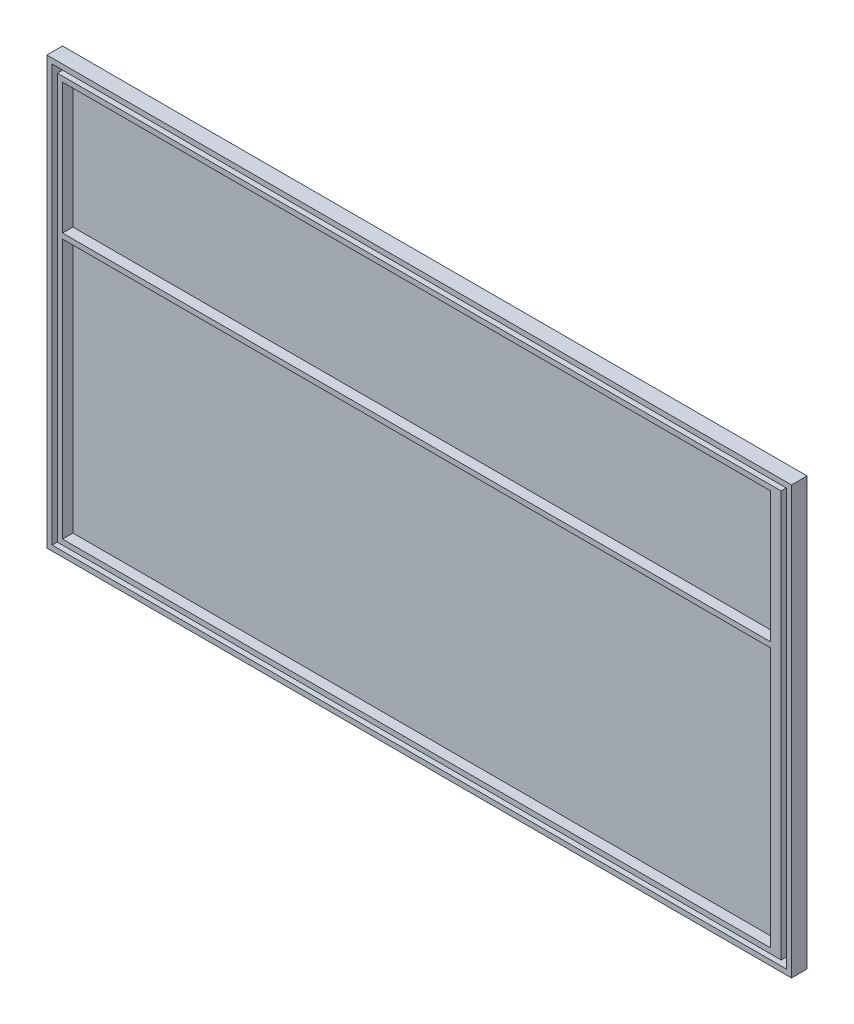
ISO-10303-21;
HEADER;
FILE_DESCRIPTION(('STEP AP214'),'2;1');
FILE_NAME('part.step','',(''),(''),'','','');
FILE_SCHEMA(('AUTOMOTIVE_DESIGN { 1 0 10303 214 1 1 1 1 }'));
ENDSEC;
DATA;
#1=APPLICATION_CONTEXT('core data for automotive mechanical design processes');
#2=APPLICATION_PROTOCOL_DEFINITION('international standard','automotive_design',2000,#1);
#3=PRODUCT_CONTEXT('',#1,'mechanical');
#4=PRODUCT('Part','Part','',(#3));
#5=PRODUCT_RELATED_PRODUCT_CATEGORY('part','',(#4));
#6=PRODUCT_DEFINITION_FORMATION('','',#4);
#7=PRODUCT_DEFINITION_CONTEXT('part definition',#1,'design');
#8=PRODUCT_DEFINITION('design','',#6,#7);
#9=PRODUCT_DEFINITION_SHAPE('','',#8);
#10=(LENGTH_UNIT() NAMED_UNIT(*) SI_UNIT(.MILLI.,.METRE.));
#11=(NAMED_UNIT(*) PLANE_ANGLE_UNIT() SI_UNIT($,.RADIAN.));
#12=(NAMED_UNIT(*) SI_UNIT($,.STERADIAN.) SOLID_ANGLE_UNIT());
#13=UNCERTAINTY_MEASURE_WITH_UNIT(LENGTH_MEASURE(1.E-05),#10,'distance_accuracy_value','');
#14=(GEOMETRIC_REPRESENTATION_CONTEXT(3) GLOBAL_UNCERTAINTY_ASSIGNED_CONTEXT((#13)) GLOBAL_UNIT_ASSIGNED_CONTEXT((#10,
#11,#12)) REPRESENTATION_CONTEXT('',''));
#15=CARTESIAN_POINT('',(0.,0.,0.));
#16=DIRECTION('',(0.,0.,1.));
#17=DIRECTION('',(1.,0.,0.));
#18=AXIS2_PLACEMENT_3D('',#15,#16,#17);
#19=CARTESIAN_POINT('',(0.,0.,1.));
#20=DIRECTION('',(0.,0.,1.));
#21=DIRECTION('',(1.,0.,0.));
#22=AXIS2_PLACEMENT_3D('',#19,#20,#21);
#23=PLANE('',#22);
#24=DIRECTION('',(0.,-1.,0.));
#25=VECTOR('',#24,1.);
#26=CARTESIAN_POINT('',(-30.0228259219912,0.,1.));
#27=LINE('',#26,#25);
#28=CARTESIAN_POINT('',(-30.0228259219912,53.2939393939394,1.));
#29=VERTEX_POINT('',#28);
#30=CARTESIAN_POINT('',(-30.0228259219912,-24.7060606060606,1.));
#31=VERTEX_POINT('',#30);
#32=EDGE_CURVE('E297',#29,#31,#27,.T.);
#33=ORIENTED_EDGE('',*,*,#32,.T.);
#34=DIRECTION('',(1.,0.,0.));
#35=VECTOR('',#34,1.);
#36=CARTESIAN_POINT('',(0.,-24.7060606060606,1.));
#37=LINE('',#36,#35);
#38=CARTESIAN_POINT('',(-169.022825921991,-24.7060606060606,1.));
#39=VERTEX_POINT('',#38);
#40=EDGE_CURVE('E305',#39,#31,#37,.T.);
#41=ORIENTED_EDGE('',*,*,#40,.F.);
#42=DIRECTION('',(0.,-1.,0.));
#43=VECTOR('',#42,1.);
#44=CARTESIAN_POINT('',(-169.022825921991,0.,1.));
#45=LINE('',#44,#43);
#46=CARTESIAN_POINT('',(-169.022825921991,53.2939393939394,1.));
#47=VERTEX_POINT('',#46);
#48=EDGE_CURVE('E303',#47,#39,#45,.T.);
#49=ORIENTED_EDGE('',*,*,#48,.F.);
#50=DIRECTION('',(1.,0.,0.));
#51=VECTOR('',#50,1.);
#52=CARTESIAN_POINT('',(0.,53.2939393939394,1.));
#53=LINE('',#52,#51);
#54=EDGE_CURVE('E300',#47,#29,#53,.T.);
#55=ORIENTED_EDGE('',*,*,#54,.T.);
#56=EDGE_LOOP('',(#33,#41,#49,#55));
#57=FACE_BOUND('',#56,.T.);
#58=DIRECTION('',(0.,-1.,0.));
#59=VECTOR('',#58,1.);
#60=CARTESIAN_POINT('',(-29.0228259219912,0.,1.));
#61=LINE('',#60,#59);
#62=CARTESIAN_POINT('',(-29.0228259219912,54.2939393939394,1.));
#63=VERTEX_POINT('',#62);
#64=CARTESIAN_POINT('',(-29.0228259219912,-25.7060606060606,1.));
#65=VERTEX_POINT('',#64);
#66=EDGE_CURVE('E74',#63,#65,#61,.T.);
#67=ORIENTED_EDGE('',*,*,#66,.F.);
#68=DIRECTION('',(1.,0.,0.));
#69=VECTOR('',#68,1.);
#70=CARTESIAN_POINT('',(0.,54.2939393939394,1.));
#71=LINE('',#70,#69);
#72=CARTESIAN_POINT('',(-170.022825921991,54.2939393939394,1.));
#73=VERTEX_POINT('',#72);
#74=EDGE_CURVE('E238',#73,#63,#71,.T.);
#75=ORIENTED_EDGE('',*,*,#74,.F.);
#76=DIRECTION('',(0.,-1.,0.));
#77=VECTOR('',#76,1.);
#78=CARTESIAN_POINT('',(-170.022825921991,0.,1.));
#79=LINE('',#78,#77);
#80=CARTESIAN_POINT('',(-170.022825921991,-25.7060606060606,1.));
#81=VERTEX_POINT('',#80);
#82=EDGE_CURVE('E220',#73,#81,#79,.T.);
#83=ORIENTED_EDGE('',*,*,#82,.T.);
#84=DIRECTION('',(1.,0.,0.));
#85=VECTOR('',#84,1.);
#86=CARTESIAN_POINT('',(0.,-25.7060606060606,1.));
#87=LINE('',#86,#85);
#88=EDGE_CURVE('E79',#81,#65,#87,.T.);
#89=ORIENTED_EDGE('',*,*,#88,.T.);
#90=EDGE_LOOP('',(#67,#75,#83,#89));
#91=FACE_BOUND('',#90,.T.);
#92=ADVANCED_FACE('F59',(#57,#91),#23,.T.);
#93=CARTESIAN_POINT('',(0.,26.189790942779,3.));
#94=DIRECTION('',(0.,-1.,0.));
#95=DIRECTION('',(0.,0.,-1.));
#96=AXIS2_PLACEMENT_3D('',#93,#94,#95);
#97=PLANE('',#96);
#98=DIRECTION('',(-1.,0.,0.));
#99=VECTOR('',#98,1.);
#100=CARTESIAN_POINT('',(0.,26.189790942779,1.));
#101=LINE('',#100,#99);
#102=CARTESIAN_POINT('',(-32.0228259219912,26.189790942779,1.));
#103=VERTEX_POINT('',#102);
#104=CARTESIAN_POINT('',(-168.022825921991,26.189790942779,1.));
#105=VERTEX_POINT('',#104);
#106=EDGE_CURVE('E308',#103,#105,#101,.T.);
#107=ORIENTED_EDGE('',*,*,#106,.F.);
#108=DIRECTION('',(0.,0.,-1.));
#109=VECTOR('',#108,1.);
#110=CARTESIAN_POINT('',(-32.0228259219912,26.189790942779,3.));
#111=LINE('',#110,#109);
#112=CARTESIAN_POINT('',(-32.0228259219912,26.189790942779,3.));
#113=VERTEX_POINT('',#112);
#114=EDGE_CURVE('E326',#113,#103,#111,.T.);
#115=ORIENTED_EDGE('',*,*,#114,.F.);
#116=DIRECTION('',(-1.,0.,0.));
#117=VECTOR('',#116,1.);
#118=CARTESIAN_POINT('',(0.,26.189790942779,3.));
#119=LINE('',#118,#117);
#120=CARTESIAN_POINT('',(-168.022825921991,26.189790942779,3.));
#121=VERTEX_POINT('',#120);
#122=EDGE_CURVE('E275',#113,#121,#119,.T.);
#123=ORIENTED_EDGE('',*,*,#122,.T.);
#124=DIRECTION('',(0.,0.,-1.));
#125=VECTOR('',#124,1.);
#126=CARTESIAN_POINT('',(-168.022825921991,26.189790942779,3.));
#127=LINE('',#126,#125);
#128=EDGE_CURVE('E316',#121,#105,#127,.T.);
#129=ORIENTED_EDGE('',*,*,#128,.T.);
#130=EDGE_LOOP('',(#107,#115,#123,#129));
#131=FACE_BOUND('',#130,.T.);
#132=ADVANCED_FACE('F370',(#131),#97,.T.);
#133=CARTESIAN_POINT('',(-32.0228259219912,0.,3.));
#134=DIRECTION('',(1.,0.,0.));
#135=DIRECTION('',(0.,0.,-1.));
#136=AXIS2_PLACEMENT_3D('',#133,#134,#135);
#137=PLANE('',#136);
#138=DIRECTION('',(0.,-1.,0.));
#139=VECTOR('',#138,1.);
#140=CARTESIAN_POINT('',(-32.0228259219912,0.,1.));
#141=LINE('',#140,#139);
#142=CARTESIAN_POINT('',(-32.0228259219912,-23.7060606060606,1.));
#143=VERTEX_POINT('',#142);
#144=EDGE_CURVE('E310',#103,#143,#141,.T.);
#145=ORIENTED_EDGE('',*,*,#144,.T.);
#146=DIRECTION('',(0.,0.,-1.));
#147=VECTOR('',#146,1.);
#148=CARTESIAN_POINT('',(-32.0228259219912,-23.7060606060606,3.));
#149=LINE('',#148,#147);
#150=CARTESIAN_POINT('',(-32.0228259219912,-23.7060606060606,3.));
#151=VERTEX_POINT('',#150);
#152=EDGE_CURVE('E323',#151,#143,#149,.T.);
#153=ORIENTED_EDGE('',*,*,#152,.F.);
#154=DIRECTION('',(0.,-1.,0.));
#155=VECTOR('',#154,1.);
#156=CARTESIAN_POINT('',(-32.0228259219912,0.,3.));
#157=LINE('',#156,#155);
#158=EDGE_CURVE('E278',#113,#151,#157,.T.);
#159=ORIENTED_EDGE('',*,*,#158,.F.);
#160=ORIENTED_EDGE('',*,*,#114,.T.);
#161=EDGE_LOOP('',(#145,#153,#159,#160));
#162=FACE_BOUND('',#161,.T.);
#163=ADVANCED_FACE('F378',(#162),#137,.F.);
#164=CARTESIAN_POINT('',(0.,-23.7060606060606,3.));
#165=DIRECTION('',(0.,1.,0.));
#166=DIRECTION('',(0.,0.,1.));
#167=AXIS2_PLACEMENT_3D('',#164,#165,#166);
#168=PLANE('',#167);
#169=DIRECTION('',(1.,0.,0.));
#170=VECTOR('',#169,1.);
#171=CARTESIAN_POINT('',(0.,-23.7060606060606,1.));
#172=LINE('',#171,#170);
#173=CARTESIAN_POINT('',(-168.022825921991,-23.7060606060606,1.));
#174=VERTEX_POINT('',#173);
#175=EDGE_CURVE('E313',#174,#143,#172,.T.);
#176=ORIENTED_EDGE('',*,*,#175,.F.);
#177=DIRECTION('',(0.,0.,-1.));
#178=VECTOR('',#177,1.);
#179=CARTESIAN_POINT('',(-168.022825921991,-23.7060606060606,3.));
#180=LINE('',#179,#178);
#181=CARTESIAN_POINT('',(-168.022825921991,-23.7060606060606,3.));
#182=VERTEX_POINT('',#181);
#183=EDGE_CURVE('E319',#182,#174,#180,.T.);
#184=ORIENTED_EDGE('',*,*,#183,.F.);
#185=DIRECTION('',(1.,0.,0.));
#186=VECTOR('',#185,1.);
#187=CARTESIAN_POINT('',(0.,-23.7060606060606,3.));
#188=LINE('',#187,#186);
#189=EDGE_CURVE('E280',#182,#151,#188,.T.);
#190=ORIENTED_EDGE('',*,*,#189,.T.);
#191=ORIENTED_EDGE('',*,*,#152,.T.);
#192=EDGE_LOOP('',(#176,#184,#190,#191));
#193=FACE_BOUND('',#192,.T.);
#194=ADVANCED_FACE('F403',(#193),#168,.T.);
#195=CARTESIAN_POINT('',(-30.0228259219912,0.,3.));
#196=DIRECTION('',(1.,0.,0.));
#197=DIRECTION('',(0.,1.,0.));
#198=AXIS2_PLACEMENT_3D('',#195,#196,#197);
#199=PLANE('',#198);
#200=ORIENTED_EDGE('',*,*,#32,.F.);
#201=DIRECTION('',(0.,0.,-1.));
#202=VECTOR('',#201,1.);
#203=CARTESIAN_POINT('',(-30.0228259219912,53.2939393939394,3.));
#204=LINE('',#203,#202);
#205=CARTESIAN_POINT('',(-30.0228259219912,53.2939393939394,3.));
#206=VERTEX_POINT('',#205);
#207=EDGE_CURVE('E320',#206,#29,#204,.T.);
#208=ORIENTED_EDGE('',*,*,#207,.F.);
#209=DIRECTION('',(0.,-1.,0.));
#210=VECTOR('',#209,1.);
#211=CARTESIAN_POINT('',(-30.0228259219912,0.,3.));
#212=LINE('',#211,#210);
#213=CARTESIAN_POINT('',(-30.0228259219912,-24.7060606060606,3.));
#214=VERTEX_POINT('',#213);
#215=EDGE_CURVE('E264',#206,#214,#212,.T.);
#216=ORIENTED_EDGE('',*,*,#215,.T.);
#217=DIRECTION('',(0.,0.,-1.));
#218=VECTOR('',#217,1.);
#219=CARTESIAN_POINT('',(-30.0228259219912,-24.7060606060606,3.));
#220=LINE('',#219,#218);
#221=EDGE_CURVE('E330',#214,#31,#220,.T.);
#222=ORIENTED_EDGE('',*,*,#221,.T.);
#223=EDGE_LOOP('',(#200,#208,#216,#222));
#224=FACE_BOUND('',#223,.T.);
#225=ADVANCED_FACE('F413',(#224),#199,.T.);
#226=CARTESIAN_POINT('',(0.,53.2939393939394,3.));
#227=DIRECTION('',(0.,1.,0.));
#228=DIRECTION('',(0.,0.,1.));
#229=AXIS2_PLACEMENT_3D('',#226,#227,#228);
#230=PLANE('',#229);
#231=ORIENTED_EDGE('',*,*,#54,.F.);
#232=DIRECTION('',(0.,0.,-1.));
#233=VECTOR('',#232,1.);
#234=CARTESIAN_POINT('',(-169.022825921991,53.2939393939394,3.));
#235=LINE('',#234,#233);
#236=CARTESIAN_POINT('',(-169.022825921991,53.2939393939394,3.));
#237=VERTEX_POINT('',#236);
#238=EDGE_CURVE('E336',#237,#47,#235,.T.);
#239=ORIENTED_EDGE('',*,*,#238,.F.);
#240=DIRECTION('',(1.,0.,0.));
#241=VECTOR('',#240,1.);
#242=CARTESIAN_POINT('',(0.,53.2939393939394,3.));
#243=LINE('',#242,#241);
#244=EDGE_CURVE('E267',#237,#206,#243,.T.);
#245=ORIENTED_EDGE('',*,*,#244,.T.);
#246=ORIENTED_EDGE('',*,*,#207,.T.);
#247=EDGE_LOOP('',(#231,#239,#245,#246));
#248=FACE_BOUND('',#247,.T.);
#249=ADVANCED_FACE('F427',(#248),#230,.T.);
#250=CARTESIAN_POINT('',(-169.022825921991,0.,3.));
#251=DIRECTION('',(1.,0.,0.));
#252=DIRECTION('',(0.,0.,-1.));
#253=AXIS2_PLACEMENT_3D('',#250,#251,#252);
#254=PLANE('',#253);
#255=ORIENTED_EDGE('',*,*,#48,.T.);
#256=DIRECTION('',(0.,0.,-1.));
#257=VECTOR('',#256,1.);
#258=CARTESIAN_POINT('',(-169.022825921991,-24.7060606060606,3.));
#259=LINE('',#258,#257);
#260=CARTESIAN_POINT('',(-169.022825921991,-24.7060606060606,3.));
#261=VERTEX_POINT('',#260);
#262=EDGE_CURVE('E332',#261,#39,#259,.T.);
#263=ORIENTED_EDGE('',*,*,#262,.F.);
#264=DIRECTION('',(0.,-1.,0.));
#265=VECTOR('',#264,1.);
#266=CARTESIAN_POINT('',(-169.022825921991,0.,3.));
#267=LINE('',#266,#265);
#268=EDGE_CURVE('E270',#237,#261,#267,.T.);
#269=ORIENTED_EDGE('',*,*,#268,.F.);
#270=ORIENTED_EDGE('',*,*,#238,.T.);
#271=EDGE_LOOP('',(#255,#263,#269,#270));
#272=FACE_BOUND('',#271,.T.);
#273=ADVANCED_FACE('F423',(#272),#254,.F.);
#274=CARTESIAN_POINT('',(-168.022825921991,0.,3.));
#275=DIRECTION('',(-1.,0.,0.));
#276=DIRECTION('',(0.,0.,1.));
#277=AXIS2_PLACEMENT_3D('',#274,#275,#276);
#278=PLANE('',#277);
#279=DIRECTION('',(0.,1.,0.));
#280=VECTOR('',#279,1.);
#281=CARTESIAN_POINT('',(-168.022825921991,0.,1.));
#282=LINE('',#281,#280);
#283=CARTESIAN_POINT('',(-168.022825921991,27.189790942779,1.));
#284=VERTEX_POINT('',#283);
#285=CARTESIAN_POINT('',(-168.022825921991,52.2939393939394,1.));
#286=VERTEX_POINT('',#285);
#287=EDGE_CURVE('E252',#284,#286,#282,.T.);
#288=ORIENTED_EDGE('',*,*,#287,.T.);
#289=DIRECTION('',(0.,0.,-1.));
#290=VECTOR('',#289,1.);
#291=CARTESIAN_POINT('',(-168.022825921991,52.2939393939394,3.));
#292=LINE('',#291,#290);
#293=CARTESIAN_POINT('',(-168.022825921991,52.2939393939394,3.));
#294=VERTEX_POINT('',#293);
#295=EDGE_CURVE('E333',#294,#286,#292,.T.);
#296=ORIENTED_EDGE('',*,*,#295,.F.);
#297=DIRECTION('',(0.,1.,0.));
#298=VECTOR('',#297,1.);
#299=CARTESIAN_POINT('',(-168.022825921991,0.,3.));
#300=LINE('',#299,#298);
#301=CARTESIAN_POINT('',(-168.022825921991,27.189790942779,3.));
#302=VERTEX_POINT('',#301);
#303=EDGE_CURVE('E253',#302,#294,#300,.T.);
#304=ORIENTED_EDGE('',*,*,#303,.F.);
#305=DIRECTION('',(0.,0.,-1.));
#306=VECTOR('',#305,1.);
#307=CARTESIAN_POINT('',(-168.022825921991,27.189790942779,3.));
#308=LINE('',#307,#306);
#309=EDGE_CURVE('E286',#302,#284,#308,.T.);
#310=ORIENTED_EDGE('',*,*,#309,.T.);
#311=EDGE_LOOP('',(#288,#296,#304,#310));
#312=FACE_BOUND('',#311,.T.);
#313=ADVANCED_FACE('F426',(#312),#278,.F.);
#314=CARTESIAN_POINT('',(0.,52.2939393939394,3.));
#315=DIRECTION('',(0.,1.,0.));
#316=DIRECTION('',(0.,0.,1.));
#317=AXIS2_PLACEMENT_3D('',#314,#315,#316);
#318=PLANE('',#317);
#319=DIRECTION('',(1.,0.,0.));
#320=VECTOR('',#319,1.);
#321=CARTESIAN_POINT('',(0.,52.2939393939394,1.));
#322=LINE('',#321,#320);
#323=CARTESIAN_POINT('',(-32.0228259219912,52.2939393939394,1.));
#324=VERTEX_POINT('',#323);
#325=EDGE_CURVE('E289',#286,#324,#322,.T.);
#326=ORIENTED_EDGE('',*,*,#325,.T.);
#327=DIRECTION('',(0.,0.,-1.));
#328=VECTOR('',#327,1.);
#329=CARTESIAN_POINT('',(-32.0228259219912,52.2939393939394,3.));
#330=LINE('',#329,#328);
#331=CARTESIAN_POINT('',(-32.0228259219912,52.2939393939394,3.));
#332=VERTEX_POINT('',#331);
#333=EDGE_CURVE('E344',#332,#324,#330,.T.);
#334=ORIENTED_EDGE('',*,*,#333,.F.);
#335=DIRECTION('',(1.,0.,0.));
#336=VECTOR('',#335,1.);
#337=CARTESIAN_POINT('',(0.,52.2939393939394,3.));
#338=LINE('',#337,#336);
#339=EDGE_CURVE('E256',#294,#332,#338,.T.);
#340=ORIENTED_EDGE('',*,*,#339,.F.);
#341=ORIENTED_EDGE('',*,*,#295,.T.);
#342=EDGE_LOOP('',(#326,#334,#340,#341));
#343=FACE_BOUND('',#342,.T.);
#344=ADVANCED_FACE('F440',(#343),#318,.F.);
#345=CARTESIAN_POINT('',(-32.0228259219912,0.,3.));
#346=DIRECTION('',(1.,0.,0.));
#347=DIRECTION('',(0.,0.,-1.));
#348=AXIS2_PLACEMENT_3D('',#345,#346,#347);
#349=PLANE('',#348);
#350=DIRECTION('',(0.,-1.,0.));
#351=VECTOR('',#350,1.);
#352=CARTESIAN_POINT('',(-32.0228259219912,0.,1.));
#353=LINE('',#352,#351);
#354=CARTESIAN_POINT('',(-32.0228259219912,27.189790942779,1.));
#355=VERTEX_POINT('',#354);
#356=EDGE_CURVE('E292',#324,#355,#353,.T.);
#357=ORIENTED_EDGE('',*,*,#356,.T.);
#358=DIRECTION('',(0.,0.,-1.));
#359=VECTOR('',#358,1.);
#360=CARTESIAN_POINT('',(-32.0228259219912,27.189790942779,3.));
#361=LINE('',#360,#359);
#362=CARTESIAN_POINT('',(-32.0228259219912,27.189790942779,3.));
#363=VERTEX_POINT('',#362);
#364=EDGE_CURVE('E341',#363,#355,#361,.T.);
#365=ORIENTED_EDGE('',*,*,#364,.F.);
#366=DIRECTION('',(0.,-1.,0.));
#367=VECTOR('',#366,1.);
#368=CARTESIAN_POINT('',(-32.0228259219912,0.,3.));
#369=LINE('',#368,#367);
#370=EDGE_CURVE('E259',#332,#363,#369,.T.);
#371=ORIENTED_EDGE('',*,*,#370,.F.);
#372=ORIENTED_EDGE('',*,*,#333,.T.);
#373=EDGE_LOOP('',(#357,#365,#371,#372));
#374=FACE_BOUND('',#373,.T.);
#375=ADVANCED_FACE('F421',(#374),#349,.F.);
#376=CARTESIAN_POINT('',(0.,-24.7060606060606,3.));
#377=DIRECTION('',(0.,1.,0.));
#378=DIRECTION('',(-1.,0.,0.));
#379=AXIS2_PLACEMENT_3D('',#376,#377,#378);
#380=PLANE('',#379);
#381=ORIENTED_EDGE('',*,*,#40,.T.);
#382=ORIENTED_EDGE('',*,*,#221,.F.);
#383=DIRECTION('',(1.,0.,0.));
#384=VECTOR('',#383,1.);
#385=CARTESIAN_POINT('',(0.,-24.7060606060606,3.));
#386=LINE('',#385,#384);
#387=EDGE_CURVE('E273',#261,#214,#386,.T.);
#388=ORIENTED_EDGE('',*,*,#387,.F.);
#389=ORIENTED_EDGE('',*,*,#262,.T.);
#390=EDGE_LOOP('',(#381,#382,#388,#389));
#391=FACE_BOUND('',#390,.T.);
#392=ADVANCED_FACE('F417',(#391),#380,.F.);
#393=CARTESIAN_POINT('',(0.,27.189790942779,3.));
#394=DIRECTION('',(0.,1.,0.));
#395=DIRECTION('',(0.,0.,1.));
#396=AXIS2_PLACEMENT_3D('',#393,#394,#395);
#397=PLANE('',#396);
#398=DIRECTION('',(1.,0.,0.));
#399=VECTOR('',#398,1.);
#400=CARTESIAN_POINT('',(0.,27.189790942779,1.));
#401=LINE('',#400,#399);
#402=EDGE_CURVE('E295',#284,#355,#401,.T.);
#403=ORIENTED_EDGE('',*,*,#402,.F.);
#404=ORIENTED_EDGE('',*,*,#309,.F.);
#405=DIRECTION('',(1.,0.,0.));
#406=VECTOR('',#405,1.);
#407=CARTESIAN_POINT('',(0.,27.189790942779,3.));
#408=LINE('',#407,#406);
#409=EDGE_CURVE('E261',#302,#363,#408,.T.);
#410=ORIENTED_EDGE('',*,*,#409,.T.);
#411=ORIENTED_EDGE('',*,*,#364,.T.);
#412=EDGE_LOOP('',(#403,#404,#410,#411));
#413=FACE_BOUND('',#412,.T.);
#414=ADVANCED_FACE('F420',(#413),#397,.T.);
#415=CARTESIAN_POINT('',(-168.022825921991,0.,3.));
#416=DIRECTION('',(1.,0.,0.));
#417=DIRECTION('',(0.,0.,-1.));
#418=AXIS2_PLACEMENT_3D('',#415,#416,#417);
#419=PLANE('',#418);
#420=DIRECTION('',(0.,-1.,0.));
#421=VECTOR('',#420,1.);
#422=CARTESIAN_POINT('',(-168.022825921991,0.,1.));
#423=LINE('',#422,#421);
#424=EDGE_CURVE('E257',#105,#174,#423,.T.);
#425=ORIENTED_EDGE('',*,*,#424,.F.);
#426=ORIENTED_EDGE('',*,*,#128,.F.);
#427=DIRECTION('',(0.,-1.,0.));
#428=VECTOR('',#427,1.);
#429=CARTESIAN_POINT('',(-168.022825921991,0.,3.));
#430=LINE('',#429,#428);
#431=EDGE_CURVE('E283',#121,#182,#430,.T.);
#432=ORIENTED_EDGE('',*,*,#431,.T.);
#433=ORIENTED_EDGE('',*,*,#183,.T.);
#434=EDGE_LOOP('',(#425,#426,#432,#433));
#435=FACE_BOUND('',#434,.T.);
#436=ADVANCED_FACE('F392',(#435),#419,.T.);
#437=CARTESIAN_POINT('',(0.,0.,3.));
#438=DIRECTION('',(0.,0.,1.));
#439=DIRECTION('',(1.,0.,0.));
#440=AXIS2_PLACEMENT_3D('',#437,#438,#439);
#441=PLANE('',#440);
#442=ORIENTED_EDGE('',*,*,#303,.T.);
#443=ORIENTED_EDGE('',*,*,#339,.T.);
#444=ORIENTED_EDGE('',*,*,#370,.T.);
#445=ORIENTED_EDGE('',*,*,#409,.F.);
#446=EDGE_LOOP('',(#442,#443,#444,#445));
#447=FACE_BOUND('',#446,.T.);
#448=ORIENTED_EDGE('',*,*,#215,.F.);
#449=ORIENTED_EDGE('',*,*,#244,.F.);
#450=ORIENTED_EDGE('',*,*,#268,.T.);
#451=ORIENTED_EDGE('',*,*,#387,.T.);
#452=EDGE_LOOP('',(#448,#449,#450,#451));
#453=FACE_BOUND('',#452,.T.);
#454=ORIENTED_EDGE('',*,*,#122,.F.);
#455=ORIENTED_EDGE('',*,*,#158,.T.);
#456=ORIENTED_EDGE('',*,*,#189,.F.);
#457=ORIENTED_EDGE('',*,*,#431,.F.);
#458=EDGE_LOOP('',(#454,#455,#456,#457));
#459=FACE_BOUND('',#458,.T.);
#460=ADVANCED_FACE('F387',(#447,#453,#459),#441,.T.);
#461=ORIENTED_EDGE('',*,*,#106,.T.);
#462=ORIENTED_EDGE('',*,*,#424,.T.);
#463=ORIENTED_EDGE('',*,*,#175,.T.);
#464=ORIENTED_EDGE('',*,*,#144,.F.);
#465=EDGE_LOOP('',(#461,#462,#463,#464));
#466=FACE_BOUND('',#465,.T.);
#467=ADVANCED_FACE('F374',(#466),#23,.T.);
#468=ORIENTED_EDGE('',*,*,#325,.F.);
#469=ORIENTED_EDGE('',*,*,#287,.F.);
#470=ORIENTED_EDGE('',*,*,#402,.T.);
#471=ORIENTED_EDGE('',*,*,#356,.F.);
#472=EDGE_LOOP('',(#468,#469,#470,#471));
#473=FACE_BOUND('',#472,.T.);
#474=ADVANCED_FACE('F373',(#473),#23,.T.);
#475=CARTESIAN_POINT('',(0.,54.2939393939394,3.));
#476=DIRECTION('',(0.,1.,0.));
#477=DIRECTION('',(0.,0.,1.));
#478=AXIS2_PLACEMENT_3D('',#475,#476,#477);
#479=PLANE('',#478);
#480=ORIENTED_EDGE('',*,*,#74,.T.);
#481=DIRECTION('',(0.,0.,-1.));
#482=VECTOR('',#481,1.);
#483=CARTESIAN_POINT('',(-29.0228259219912,54.2939393939394,3.));
#484=LINE('',#483,#482);
#485=CARTESIAN_POINT('',(-29.0228259219912,54.2939393939394,3.));
#486=VERTEX_POINT('',#485);
#487=EDGE_CURVE('E250',#486,#63,#484,.T.);
#488=ORIENTED_EDGE('',*,*,#487,.F.);
#489=DIRECTION('',(1.,0.,0.));
#490=VECTOR('',#489,1.);
#491=CARTESIAN_POINT('',(0.,54.2939393939394,3.));
#492=LINE('',#491,#490);
#493=CARTESIAN_POINT('',(-170.022825921991,54.2939393939394,3.));
#494=VERTEX_POINT('',#493);
#495=EDGE_CURVE('E226',#494,#486,#492,.T.);
#496=ORIENTED_EDGE('',*,*,#495,.F.);
#497=DIRECTION('',(0.,0.,-1.));
#498=VECTOR('',#497,1.);
#499=CARTESIAN_POINT('',(-170.022825921991,54.2939393939394,3.));
#500=LINE('',#499,#498);
#501=EDGE_CURVE('E237',#494,#73,#500,.T.);
#502=ORIENTED_EDGE('',*,*,#501,.T.);
#503=EDGE_LOOP('',(#480,#488,#496,#502));
#504=FACE_BOUND('',#503,.T.);
#505=ADVANCED_FACE('F384',(#504),#479,.F.);
#506=CARTESIAN_POINT('',(-29.0228259219912,0.,3.));
#507=DIRECTION('',(1.,0.,0.));
#508=DIRECTION('',(0.,1.,0.));
#509=AXIS2_PLACEMENT_3D('',#506,#507,#508);
#510=PLANE('',#509);
#511=ORIENTED_EDGE('',*,*,#66,.T.);
#512=DIRECTION('',(0.,0.,-1.));
#513=VECTOR('',#512,1.);
#514=CARTESIAN_POINT('',(-29.0228259219912,-25.7060606060606,3.));
#515=LINE('',#514,#513);
#516=CARTESIAN_POINT('',(-29.0228259219912,-25.7060606060606,3.));
#517=VERTEX_POINT('',#516);
#518=EDGE_CURVE('E248',#517,#65,#515,.T.);
#519=ORIENTED_EDGE('',*,*,#518,.F.);
#520=DIRECTION('',(0.,-1.,0.));
#521=VECTOR('',#520,1.);
#522=CARTESIAN_POINT('',(-29.0228259219912,0.,3.));
#523=LINE('',#522,#521);
#524=EDGE_CURVE('E229',#486,#517,#523,.T.);
#525=ORIENTED_EDGE('',*,*,#524,.F.);
#526=ORIENTED_EDGE('',*,*,#487,.T.);
#527=EDGE_LOOP('',(#511,#519,#525,#526));
#528=FACE_BOUND('',#527,.T.);
#529=ADVANCED_FACE('F514',(#528),#510,.F.);
#530=CARTESIAN_POINT('',(0.,-25.7060606060606,3.));
#531=DIRECTION('',(0.,1.,0.));
#532=DIRECTION('',(0.,0.,1.));
#533=AXIS2_PLACEMENT_3D('',#530,#531,#532);
#534=PLANE('',#533);
#535=ORIENTED_EDGE('',*,*,#88,.F.);
#536=DIRECTION('',(0.,0.,-1.));
#537=VECTOR('',#536,1.);
#538=CARTESIAN_POINT('',(-170.022825921991,-25.7060606060606,3.));
#539=LINE('',#538,#537);
#540=CARTESIAN_POINT('',(-170.022825921991,-25.7060606060606,3.));
#541=VERTEX_POINT('',#540);
#542=EDGE_CURVE('E245',#541,#81,#539,.T.);
#543=ORIENTED_EDGE('',*,*,#542,.F.);
#544=DIRECTION('',(1.,0.,0.));
#545=VECTOR('',#544,1.);
#546=CARTESIAN_POINT('',(0.,-25.7060606060606,3.));
#547=LINE('',#546,#545);
#548=EDGE_CURVE('E231',#541,#517,#547,.T.);
#549=ORIENTED_EDGE('',*,*,#548,.T.);
#550=ORIENTED_EDGE('',*,*,#518,.T.);
#551=EDGE_LOOP('',(#535,#543,#549,#550));
#552=FACE_BOUND('',#551,.T.);
#553=ADVANCED_FACE('F524',(#552),#534,.T.);
#554=CARTESIAN_POINT('',(-170.022825921991,0.,3.));
#555=DIRECTION('',(1.,0.,0.));
#556=DIRECTION('',(0.,0.,-1.));
#557=AXIS2_PLACEMENT_3D('',#554,#555,#556);
#558=PLANE('',#557);
#559=ORIENTED_EDGE('',*,*,#82,.F.);
#560=ORIENTED_EDGE('',*,*,#501,.F.);
#561=DIRECTION('',(0.,-1.,0.));
#562=VECTOR('',#561,1.);
#563=CARTESIAN_POINT('',(-170.022825921991,0.,3.));
#564=LINE('',#563,#562);
#565=EDGE_CURVE('E234',#494,#541,#564,.T.);
#566=ORIENTED_EDGE('',*,*,#565,.T.);
#567=ORIENTED_EDGE('',*,*,#542,.T.);
#568=EDGE_LOOP('',(#559,#560,#566,#567));
#569=FACE_BOUND('',#568,.T.);
#570=ADVANCED_FACE('F534',(#569),#558,.T.);
#571=CARTESIAN_POINT('',(0.,0.,3.));
#572=DIRECTION('',(0.,0.,1.));
#573=DIRECTION('',(1.,0.,0.));
#574=AXIS2_PLACEMENT_3D('',#571,#572,#573);
#575=PLANE('',#574);
#576=DIRECTION('',(-1.,0.,0.));
#577=VECTOR('',#576,1.);
#578=CARTESIAN_POINT('',(0.,55.2939393939394,3.));
#579=LINE('',#578,#577);
#580=CARTESIAN_POINT('',(-28.0228259219912,55.2939393939394,3.));
#581=VERTEX_POINT('',#580);
#582=CARTESIAN_POINT('',(-171.022825921991,55.2939393939394,3.));
#583=VERTEX_POINT('',#582);
#584=EDGE_CURVE('E200',#581,#583,#579,.T.);
#585=ORIENTED_EDGE('',*,*,#584,.T.);
#586=DIRECTION('',(0.,-1.,0.));
#587=VECTOR('',#586,1.);
#588=CARTESIAN_POINT('',(-171.022825921991,0.,3.));
#589=LINE('',#588,#587);
#590=CARTESIAN_POINT('',(-171.022825921991,-26.7060606060606,3.));
#591=VERTEX_POINT('',#590);
#592=EDGE_CURVE('E209',#583,#591,#589,.T.);
#593=ORIENTED_EDGE('',*,*,#592,.T.);
#594=DIRECTION('',(1.,0.,0.));
#595=VECTOR('',#594,1.);
#596=CARTESIAN_POINT('',(0.,-26.7060606060606,3.));
#597=LINE('',#596,#595);
#598=CARTESIAN_POINT('',(-28.0228259219912,-26.7060606060606,3.));
#599=VERTEX_POINT('',#598);
#600=EDGE_CURVE('E213',#591,#599,#597,.T.);
#601=ORIENTED_EDGE('',*,*,#600,.T.);
#602=DIRECTION('',(0.,1.,0.));
#603=VECTOR('',#602,1.);
#604=CARTESIAN_POINT('',(-28.0228259219912,0.,3.));
#605=LINE('',#604,#603);
#606=EDGE_CURVE('E219',#599,#581,#605,.T.);
#607=ORIENTED_EDGE('',*,*,#606,.T.);
#608=EDGE_LOOP('',(#585,#593,#601,#607));
#609=FACE_BOUND('',#608,.T.);
#610=ORIENTED_EDGE('',*,*,#495,.T.);
#611=ORIENTED_EDGE('',*,*,#524,.T.);
#612=ORIENTED_EDGE('',*,*,#548,.F.);
#613=ORIENTED_EDGE('',*,*,#565,.F.);
#614=EDGE_LOOP('',(#610,#611,#612,#613));
#615=FACE_BOUND('',#614,.T.);
#616=ADVANCED_FACE('F216',(#609,#615),#575,.T.);
#617=CARTESIAN_POINT('',(0.,0.,0.));
#618=DIRECTION('',(0.,0.,1.));
#619=DIRECTION('',(1.,0.,0.));
#620=AXIS2_PLACEMENT_3D('',#617,#618,#619);
#621=PLANE('',#620);
#622=DIRECTION('',(0.,-1.,0.));
#623=VECTOR('',#622,1.);
#624=CARTESIAN_POINT('',(-171.022825921991,55.2939393939394,0.));
#625=LINE('',#624,#623);
#626=CARTESIAN_POINT('',(-171.022825921991,55.2939393939394,0.));
#627=VERTEX_POINT('',#626);
#628=CARTESIAN_POINT('',(-171.022825921991,-26.7060606060606,0.));
#629=VERTEX_POINT('',#628);
#630=EDGE_CURVE('E329',#627,#629,#625,.T.);
#631=ORIENTED_EDGE('',*,*,#630,.F.);
#632=DIRECTION('',(-1.,0.,0.));
#633=VECTOR('',#632,1.);
#634=CARTESIAN_POINT('',(-171.022825921991,55.2939393939394,0.));
#635=LINE('',#634,#633);
#636=CARTESIAN_POINT('',(-28.0228259219912,55.2939393939394,0.));
#637=VERTEX_POINT('',#636);
#638=EDGE_CURVE('E202',#637,#627,#635,.T.);
#639=ORIENTED_EDGE('',*,*,#638,.F.);
#640=DIRECTION('',(0.,1.,0.));
#641=VECTOR('',#640,1.);
#642=CARTESIAN_POINT('',(-28.0228259219912,55.2939393939394,0.));
#643=LINE('',#642,#641);
#644=CARTESIAN_POINT('',(-28.0228259219912,-26.7060606060606,0.));
#645=VERTEX_POINT('',#644);
#646=EDGE_CURVE('E352',#645,#637,#643,.T.);
#647=ORIENTED_EDGE('',*,*,#646,.F.);
#648=DIRECTION('',(1.,0.,0.));
#649=VECTOR('',#648,1.);
#650=CARTESIAN_POINT('',(-171.022825921991,-26.7060606060606,0.));
#651=LINE('',#650,#649);
#652=EDGE_CURVE('E350',#629,#645,#651,.T.);
#653=ORIENTED_EDGE('',*,*,#652,.F.);
#654=EDGE_LOOP('',(#631,#639,#647,#653));
#655=FACE_BOUND('',#654,.T.);
#656=ADVANCED_FACE('F361',(#655),#621,.F.);
#657=CARTESIAN_POINT('',(-171.022825921991,55.2939393939394,1.));
#658=DIRECTION('',(0.,-1.,0.));
#659=DIRECTION('',(0.,0.,-1.));
#660=AXIS2_PLACEMENT_3D('',#657,#658,#659);
#661=PLANE('',#660);
#662=ORIENTED_EDGE('',*,*,#638,.T.);
#663=DIRECTION('',(0.,0.,-1.));
#664=VECTOR('',#663,1.);
#665=CARTESIAN_POINT('',(-171.022825921991,55.2939393939394,1.));
#666=LINE('',#665,#664);
#667=EDGE_CURVE('E195',#583,#627,#666,.T.);
#668=ORIENTED_EDGE('',*,*,#667,.F.);
#669=ORIENTED_EDGE('',*,*,#584,.F.);
#670=DIRECTION('',(0.,0.,-1.));
#671=VECTOR('',#670,1.);
#672=CARTESIAN_POINT('',(-28.0228259219912,55.2939393939394,1.));
#673=LINE('',#672,#671);
#674=EDGE_CURVE('E206',#581,#637,#673,.T.);
#675=ORIENTED_EDGE('',*,*,#674,.T.);
#676=EDGE_LOOP('',(#662,#668,#669,#675));
#677=FACE_BOUND('',#676,.T.);
#678=ADVANCED_FACE('F197',(#677),#661,.F.);
#679=CARTESIAN_POINT('',(-28.0228259219912,55.2939393939394,1.));
#680=DIRECTION('',(-1.,0.,0.));
#681=DIRECTION('',(0.,0.,1.));
#682=AXIS2_PLACEMENT_3D('',#679,#680,#681);
#683=PLANE('',#682);
#684=ORIENTED_EDGE('',*,*,#646,.T.);
#685=ORIENTED_EDGE('',*,*,#674,.F.);
#686=ORIENTED_EDGE('',*,*,#606,.F.);
#687=DIRECTION('',(0.,0.,-1.));
#688=VECTOR('',#687,1.);
#689=CARTESIAN_POINT('',(-28.0228259219912,-26.7060606060606,1.));
#690=LINE('',#689,#688);
#691=EDGE_CURVE('E67',#599,#645,#690,.T.);
#692=ORIENTED_EDGE('',*,*,#691,.T.);
#693=EDGE_LOOP('',(#684,#685,#686,#692));
#694=FACE_BOUND('',#693,.T.);
#695=ADVANCED_FACE('F358',(#694),#683,.F.);
#696=CARTESIAN_POINT('',(-171.022825921991,-26.7060606060606,1.));
#697=DIRECTION('',(0.,1.,0.));
#698=DIRECTION('',(0.,0.,1.));
#699=AXIS2_PLACEMENT_3D('',#696,#697,#698);
#700=PLANE('',#699);
#701=ORIENTED_EDGE('',*,*,#652,.T.);
#702=ORIENTED_EDGE('',*,*,#691,.F.);
#703=ORIENTED_EDGE('',*,*,#600,.F.);
#704=DIRECTION('',(0.,0.,-1.));
#705=VECTOR('',#704,1.);
#706=CARTESIAN_POINT('',(-171.022825921991,-26.7060606060606,1.));
#707=LINE('',#706,#705);
#708=EDGE_CURVE('E12',#591,#629,#707,.T.);
#709=ORIENTED_EDGE('',*,*,#708,.T.);
#710=EDGE_LOOP('',(#701,#702,#703,#709));
#711=FACE_BOUND('',#710,.T.);
#712=ADVANCED_FACE('F362',(#711),#700,.F.);
#713=CARTESIAN_POINT('',(-171.022825921991,55.2939393939394,1.));
#714=DIRECTION('',(1.,0.,0.));
#715=DIRECTION('',(0.,0.,-1.));
#716=AXIS2_PLACEMENT_3D('',#713,#714,#715);
#717=PLANE('',#716);
#718=ORIENTED_EDGE('',*,*,#630,.T.);
#719=ORIENTED_EDGE('',*,*,#708,.F.);
#720=ORIENTED_EDGE('',*,*,#592,.F.);
#721=ORIENTED_EDGE('',*,*,#667,.T.);
#722=EDGE_LOOP('',(#718,#719,#720,#721));
#723=FACE_BOUND('',#722,.T.);
#724=ADVANCED_FACE('F61',(#723),#717,.F.);
#725=CLOSED_SHELL('',(#92,#132,#163,#194,#225,#249,#273,#313,#344,#375,#392,#414,#436,#460,#467,
#474,#505,#529,#553,#570,#616,#656,#678,#695,#712,#724));
#726=MANIFOLD_SOLID_BREP('B2',#725);
#727=ADVANCED_BREP_SHAPE_REPRESENTATION('',(#18,#726),#14);
#728=SHAPE_DEFINITION_REPRESENTATION(#9,#727);
ENDSEC;
END-ISO-10303-21;
